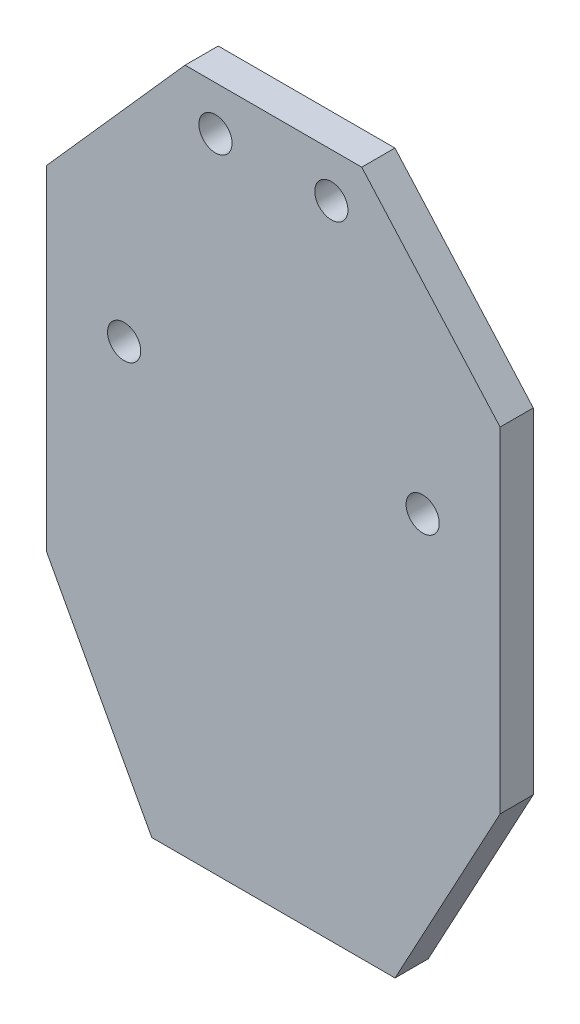
ISO-10303-21;
HEADER;
FILE_DESCRIPTION(('STEP AP214'),'2;1');
FILE_NAME('part.step','',(''),(''),'','','');
FILE_SCHEMA(('AUTOMOTIVE_DESIGN { 1 0 10303 214 1 1 1 1 }'));
ENDSEC;
DATA;
#1=APPLICATION_CONTEXT('core data for automotive mechanical design processes');
#2=APPLICATION_PROTOCOL_DEFINITION('international standard','automotive_design',2000,#1);
#3=PRODUCT_CONTEXT('',#1,'mechanical');
#4=PRODUCT('Part','Part','',(#3));
#5=PRODUCT_RELATED_PRODUCT_CATEGORY('part','',(#4));
#6=PRODUCT_DEFINITION_FORMATION('','',#4);
#7=PRODUCT_DEFINITION_CONTEXT('part definition',#1,'design');
#8=PRODUCT_DEFINITION('design','',#6,#7);
#9=PRODUCT_DEFINITION_SHAPE('','',#8);
#10=(LENGTH_UNIT() NAMED_UNIT(*) SI_UNIT(.MILLI.,.METRE.));
#11=(NAMED_UNIT(*) PLANE_ANGLE_UNIT() SI_UNIT($,.RADIAN.));
#12=(NAMED_UNIT(*) SI_UNIT($,.STERADIAN.) SOLID_ANGLE_UNIT());
#13=UNCERTAINTY_MEASURE_WITH_UNIT(LENGTH_MEASURE(1.E-05),#10,'distance_accuracy_value','');
#14=(GEOMETRIC_REPRESENTATION_CONTEXT(3) GLOBAL_UNCERTAINTY_ASSIGNED_CONTEXT((#13)) GLOBAL_UNIT_ASSIGNED_CONTEXT((#10,
#11,#12)) REPRESENTATION_CONTEXT('',''));
#15=CARTESIAN_POINT('',(0.,0.,0.));
#16=DIRECTION('',(0.,0.,1.));
#17=DIRECTION('',(1.,0.,0.));
#18=AXIS2_PLACEMENT_3D('',#15,#16,#17);
#19=CARTESIAN_POINT('',(0.,0.,3.));
#20=DIRECTION('',(0.,0.,-1.));
#21=DIRECTION('',(-1.,0.,0.));
#22=AXIS2_PLACEMENT_3D('',#19,#20,#21);
#23=PLANE('',#22);
#24=DIRECTION('',(0.475,-0.879985795339902,0.));
#25=VECTOR('',#24,1.);
#26=CARTESIAN_POINT('',(-11.,0.,3.));
#27=LINE('',#26,#25);
#28=CARTESIAN_POINT('',(-20.5,17.599715906798,3.));
#29=VERTEX_POINT('',#28);
#30=CARTESIAN_POINT('',(-11.,0.,3.));
#31=VERTEX_POINT('',#30);
#32=EDGE_CURVE('E153',#29,#31,#27,.T.);
#33=ORIENTED_EDGE('',*,*,#32,.T.);
#34=DIRECTION('',(1.,0.,0.));
#35=VECTOR('',#34,1.);
#36=CARTESIAN_POINT('',(11.,0.,3.));
#37=LINE('',#36,#35);
#38=CARTESIAN_POINT('',(11.,0.,3.));
#39=VERTEX_POINT('',#38);
#40=EDGE_CURVE('E101',#31,#39,#37,.T.);
#41=ORIENTED_EDGE('',*,*,#40,.T.);
#42=DIRECTION('',(0.475,0.879985795339902,0.));
#43=VECTOR('',#42,1.);
#44=CARTESIAN_POINT('',(11.,0.,3.));
#45=LINE('',#44,#43);
#46=CARTESIAN_POINT('',(20.5,17.599715906798,3.));
#47=VERTEX_POINT('',#46);
#48=EDGE_CURVE('E168',#39,#47,#45,.T.);
#49=ORIENTED_EDGE('',*,*,#48,.T.);
#50=DIRECTION('',(0.,1.,0.));
#51=VECTOR('',#50,1.);
#52=CARTESIAN_POINT('',(20.5,17.599715906798,3.));
#53=LINE('',#52,#51);
#54=CARTESIAN_POINT('',(20.5,47.899715906798,3.));
#55=VERTEX_POINT('',#54);
#56=EDGE_CURVE('E181',#47,#55,#53,.T.);
#57=ORIENTED_EDGE('',*,*,#56,.T.);
#58=DIRECTION('',(-0.663669782392083,0.748025681336975,0.));
#59=VECTOR('',#58,1.);
#60=CARTESIAN_POINT('',(20.5,47.899715906798,3.));
#61=LINE('',#60,#59);
#62=CARTESIAN_POINT('',(7.98982460190923,62.,3.));
#63=VERTEX_POINT('',#62);
#64=EDGE_CURVE('E120',#55,#63,#61,.T.);
#65=ORIENTED_EDGE('',*,*,#64,.T.);
#66=DIRECTION('',(-1.,0.,0.));
#67=VECTOR('',#66,1.);
#68=CARTESIAN_POINT('',(-7.98982460190923,62.,3.));
#69=LINE('',#68,#67);
#70=CARTESIAN_POINT('',(-7.98982460190923,62.,3.));
#71=VERTEX_POINT('',#70);
#72=EDGE_CURVE('E114',#63,#71,#69,.T.);
#73=ORIENTED_EDGE('',*,*,#72,.T.);
#74=DIRECTION('',(-0.663669782392083,-0.748025681336975,0.));
#75=VECTOR('',#74,1.);
#76=CARTESIAN_POINT('',(-20.5,47.899715906798,3.));
#77=LINE('',#76,#75);
#78=CARTESIAN_POINT('',(-20.5,47.899715906798,3.));
#79=VERTEX_POINT('',#78);
#80=EDGE_CURVE('E118',#71,#79,#77,.T.);
#81=ORIENTED_EDGE('',*,*,#80,.T.);
#82=DIRECTION('',(0.,-1.,0.));
#83=VECTOR('',#82,1.);
#84=CARTESIAN_POINT('',(-20.5,17.599715906798,3.));
#85=LINE('',#84,#83);
#86=EDGE_CURVE('E58',#79,#29,#85,.T.);
#87=ORIENTED_EDGE('',*,*,#86,.T.);
#88=EDGE_LOOP('',(#33,#41,#49,#57,#65,#73,#81,#87));
#89=FACE_BOUND('',#88,.T.);
#90=CARTESIAN_POINT('',(-5.23982460190923,58.,3.));
#91=DIRECTION('',(0.,0.,1.));
#92=DIRECTION('',(1.,0.,0.));
#93=AXIS2_PLACEMENT_3D('',#90,#91,#92);
#94=CIRCLE('',#93,1.5);
#95=CARTESIAN_POINT('',(-3.73982460190923,58.,3.));
#96=VERTEX_POINT('',#95);
#97=EDGE_CURVE('E142',#96,#96,#94,.T.);
#98=ORIENTED_EDGE('',*,*,#97,.F.);
#99=EDGE_LOOP('',(#98));
#100=FACE_BOUND('',#99,.T.);
#101=CARTESIAN_POINT('',(-13.5,37.599715906798,3.));
#102=DIRECTION('',(0.,0.,1.));
#103=DIRECTION('',(1.,0.,0.));
#104=AXIS2_PLACEMENT_3D('',#101,#102,#103);
#105=CIRCLE('',#104,1.5);
#106=CARTESIAN_POINT('',(-12.,37.599715906798,3.));
#107=VERTEX_POINT('',#106);
#108=EDGE_CURVE('E190',#107,#107,#105,.T.);
#109=ORIENTED_EDGE('',*,*,#108,.F.);
#110=EDGE_LOOP('',(#109));
#111=FACE_BOUND('',#110,.T.);
#112=CARTESIAN_POINT('',(13.5,37.599715906798,3.));
#113=DIRECTION('',(0.,0.,1.));
#114=DIRECTION('',(-1.,0.,0.));
#115=AXIS2_PLACEMENT_3D('',#112,#113,#114);
#116=CIRCLE('',#115,1.5);
#117=CARTESIAN_POINT('',(12.,37.599715906798,3.));
#118=VERTEX_POINT('',#117);
#119=EDGE_CURVE('E196',#118,#118,#116,.T.);
#120=ORIENTED_EDGE('',*,*,#119,.F.);
#121=EDGE_LOOP('',(#120));
#122=FACE_BOUND('',#121,.T.);
#123=CARTESIAN_POINT('',(5.23982460190923,58.,3.));
#124=DIRECTION('',(0.,0.,1.));
#125=DIRECTION('',(-1.,0.,0.));
#126=AXIS2_PLACEMENT_3D('',#123,#124,#125);
#127=CIRCLE('',#126,1.5);
#128=CARTESIAN_POINT('',(3.73982460190923,58.,3.));
#129=VERTEX_POINT('',#128);
#130=EDGE_CURVE('E202',#129,#129,#127,.T.);
#131=ORIENTED_EDGE('',*,*,#130,.F.);
#132=EDGE_LOOP('',(#131));
#133=FACE_BOUND('',#132,.T.);
#134=ADVANCED_FACE('F41',(#89,#100,#111,#122,#133),#23,.F.);
#135=CARTESIAN_POINT('',(0.,0.,0.));
#136=DIRECTION('',(0.,0.,-1.));
#137=DIRECTION('',(-1.,0.,0.));
#138=AXIS2_PLACEMENT_3D('',#135,#136,#137);
#139=PLANE('',#138);
#140=CARTESIAN_POINT('',(13.5,37.599715906798,0.));
#141=DIRECTION('',(0.,0.,1.));
#142=DIRECTION('',(-1.,0.,0.));
#143=AXIS2_PLACEMENT_3D('',#140,#141,#142);
#144=CIRCLE('',#143,1.5);
#145=CARTESIAN_POINT('',(12.,37.599715906798,0.));
#146=VERTEX_POINT('',#145);
#147=EDGE_CURVE('E199',#146,#146,#144,.T.);
#148=ORIENTED_EDGE('',*,*,#147,.T.);
#149=EDGE_LOOP('',(#148));
#150=FACE_BOUND('',#149,.T.);
#151=CARTESIAN_POINT('',(-5.23982460190923,58.,0.));
#152=DIRECTION('',(0.,0.,1.));
#153=DIRECTION('',(1.,0.,0.));
#154=AXIS2_PLACEMENT_3D('',#151,#152,#153);
#155=CIRCLE('',#154,1.5);
#156=CARTESIAN_POINT('',(-3.73982460190923,58.,0.));
#157=VERTEX_POINT('',#156);
#158=EDGE_CURVE('E187',#157,#157,#155,.T.);
#159=ORIENTED_EDGE('',*,*,#158,.T.);
#160=EDGE_LOOP('',(#159));
#161=FACE_BOUND('',#160,.T.);
#162=DIRECTION('',(0.475,-0.879985795339902,0.));
#163=VECTOR('',#162,1.);
#164=CARTESIAN_POINT('',(-11.,0.,0.));
#165=LINE('',#164,#163);
#166=CARTESIAN_POINT('',(-20.5,17.599715906798,0.));
#167=VERTEX_POINT('',#166);
#168=CARTESIAN_POINT('',(-11.,0.,0.));
#169=VERTEX_POINT('',#168);
#170=EDGE_CURVE('E138',#167,#169,#165,.T.);
#171=ORIENTED_EDGE('',*,*,#170,.F.);
#172=DIRECTION('',(0.,-1.,0.));
#173=VECTOR('',#172,1.);
#174=CARTESIAN_POINT('',(-20.5,17.599715906798,0.));
#175=LINE('',#174,#173);
#176=CARTESIAN_POINT('',(-20.5,47.899715906798,0.));
#177=VERTEX_POINT('',#176);
#178=EDGE_CURVE('E93',#177,#167,#175,.T.);
#179=ORIENTED_EDGE('',*,*,#178,.F.);
#180=DIRECTION('',(-0.663669782392083,-0.748025681336975,0.));
#181=VECTOR('',#180,1.);
#182=CARTESIAN_POINT('',(-20.5,47.899715906798,0.));
#183=LINE('',#182,#181);
#184=CARTESIAN_POINT('',(-7.98982460190923,62.,0.));
#185=VERTEX_POINT('',#184);
#186=EDGE_CURVE('E87',#185,#177,#183,.T.);
#187=ORIENTED_EDGE('',*,*,#186,.F.);
#188=DIRECTION('',(-1.,0.,0.));
#189=VECTOR('',#188,1.);
#190=CARTESIAN_POINT('',(-7.98982460190923,62.,0.));
#191=LINE('',#190,#189);
#192=CARTESIAN_POINT('',(7.98982460190923,62.,0.));
#193=VERTEX_POINT('',#192);
#194=EDGE_CURVE('E128',#193,#185,#191,.T.);
#195=ORIENTED_EDGE('',*,*,#194,.F.);
#196=DIRECTION('',(-0.663669782392083,0.748025681336975,0.));
#197=VECTOR('',#196,1.);
#198=CARTESIAN_POINT('',(20.5,47.899715906798,0.));
#199=LINE('',#198,#197);
#200=CARTESIAN_POINT('',(20.5,47.899715906798,0.));
#201=VERTEX_POINT('',#200);
#202=EDGE_CURVE('E148',#201,#193,#199,.T.);
#203=ORIENTED_EDGE('',*,*,#202,.F.);
#204=DIRECTION('',(0.,1.,0.));
#205=VECTOR('',#204,1.);
#206=CARTESIAN_POINT('',(20.5,17.599715906798,0.));
#207=LINE('',#206,#205);
#208=CARTESIAN_POINT('',(20.5,17.599715906798,0.));
#209=VERTEX_POINT('',#208);
#210=EDGE_CURVE('E146',#209,#201,#207,.T.);
#211=ORIENTED_EDGE('',*,*,#210,.F.);
#212=DIRECTION('',(0.475,0.879985795339902,0.));
#213=VECTOR('',#212,1.);
#214=CARTESIAN_POINT('',(11.,0.,0.));
#215=LINE('',#214,#213);
#216=CARTESIAN_POINT('',(11.,0.,0.));
#217=VERTEX_POINT('',#216);
#218=EDGE_CURVE('E144',#217,#209,#215,.T.);
#219=ORIENTED_EDGE('',*,*,#218,.F.);
#220=DIRECTION('',(1.,0.,0.));
#221=VECTOR('',#220,1.);
#222=CARTESIAN_POINT('',(11.,0.,0.));
#223=LINE('',#222,#221);
#224=EDGE_CURVE('E141',#169,#217,#223,.T.);
#225=ORIENTED_EDGE('',*,*,#224,.F.);
#226=EDGE_LOOP('',(#171,#179,#187,#195,#203,#211,#219,#225));
#227=FACE_BOUND('',#226,.T.);
#228=CARTESIAN_POINT('',(-13.5,37.599715906798,0.));
#229=DIRECTION('',(0.,0.,1.));
#230=DIRECTION('',(1.,0.,0.));
#231=AXIS2_PLACEMENT_3D('',#228,#229,#230);
#232=CIRCLE('',#231,1.5);
#233=CARTESIAN_POINT('',(-12.,37.599715906798,0.));
#234=VERTEX_POINT('',#233);
#235=EDGE_CURVE('E193',#234,#234,#232,.T.);
#236=ORIENTED_EDGE('',*,*,#235,.T.);
#237=EDGE_LOOP('',(#236));
#238=FACE_BOUND('',#237,.T.);
#239=CARTESIAN_POINT('',(5.23982460190923,58.,0.));
#240=DIRECTION('',(0.,0.,1.));
#241=DIRECTION('',(-1.,0.,0.));
#242=AXIS2_PLACEMENT_3D('',#239,#240,#241);
#243=CIRCLE('',#242,1.5);
#244=CARTESIAN_POINT('',(3.73982460190923,58.,0.));
#245=VERTEX_POINT('',#244);
#246=EDGE_CURVE('E205',#245,#245,#243,.T.);
#247=ORIENTED_EDGE('',*,*,#246,.T.);
#248=EDGE_LOOP('',(#247));
#249=FACE_BOUND('',#248,.T.);
#250=ADVANCED_FACE('F172',(#150,#161,#227,#238,#249),#139,.T.);
#251=CARTESIAN_POINT('',(-11.,0.,3.));
#252=DIRECTION('',(0.879985795339902,0.475,0.));
#253=DIRECTION('',(-0.475,0.879985795339902,0.));
#254=AXIS2_PLACEMENT_3D('',#251,#252,#253);
#255=PLANE('',#254);
#256=ORIENTED_EDGE('',*,*,#170,.T.);
#257=DIRECTION('',(0.,0.,-1.));
#258=VECTOR('',#257,1.);
#259=CARTESIAN_POINT('',(-11.,0.,3.));
#260=LINE('',#259,#258);
#261=EDGE_CURVE('E11',#31,#169,#260,.T.);
#262=ORIENTED_EDGE('',*,*,#261,.F.);
#263=ORIENTED_EDGE('',*,*,#32,.F.);
#264=DIRECTION('',(0.,0.,-1.));
#265=VECTOR('',#264,1.);
#266=CARTESIAN_POINT('',(-20.5,17.599715906798,3.));
#267=LINE('',#266,#265);
#268=EDGE_CURVE('E134',#29,#167,#267,.T.);
#269=ORIENTED_EDGE('',*,*,#268,.T.);
#270=EDGE_LOOP('',(#256,#262,#263,#269));
#271=FACE_BOUND('',#270,.T.);
#272=ADVANCED_FACE('F43',(#271),#255,.F.);
#273=CARTESIAN_POINT('',(11.,0.,3.));
#274=DIRECTION('',(0.,1.,0.));
#275=DIRECTION('',(0.,0.,1.));
#276=AXIS2_PLACEMENT_3D('',#273,#274,#275);
#277=PLANE('',#276);
#278=ORIENTED_EDGE('',*,*,#224,.T.);
#279=DIRECTION('',(0.,0.,-1.));
#280=VECTOR('',#279,1.);
#281=CARTESIAN_POINT('',(11.,0.,3.));
#282=LINE('',#281,#280);
#283=EDGE_CURVE('E50',#39,#217,#282,.T.);
#284=ORIENTED_EDGE('',*,*,#283,.F.);
#285=ORIENTED_EDGE('',*,*,#40,.F.);
#286=ORIENTED_EDGE('',*,*,#261,.T.);
#287=EDGE_LOOP('',(#278,#284,#285,#286));
#288=FACE_BOUND('',#287,.T.);
#289=ADVANCED_FACE('F237',(#288),#277,.F.);
#290=CARTESIAN_POINT('',(11.,0.,3.));
#291=DIRECTION('',(-0.879985795339902,0.475,0.));
#292=DIRECTION('',(-0.475,-0.879985795339902,0.));
#293=AXIS2_PLACEMENT_3D('',#290,#291,#292);
#294=PLANE('',#293);
#295=ORIENTED_EDGE('',*,*,#218,.T.);
#296=DIRECTION('',(0.,0.,-1.));
#297=VECTOR('',#296,1.);
#298=CARTESIAN_POINT('',(20.5,17.599715906798,3.));
#299=LINE('',#298,#297);
#300=EDGE_CURVE('E160',#47,#209,#299,.T.);
#301=ORIENTED_EDGE('',*,*,#300,.F.);
#302=ORIENTED_EDGE('',*,*,#48,.F.);
#303=ORIENTED_EDGE('',*,*,#283,.T.);
#304=EDGE_LOOP('',(#295,#301,#302,#303));
#305=FACE_BOUND('',#304,.T.);
#306=ADVANCED_FACE('F166',(#305),#294,.F.);
#307=CARTESIAN_POINT('',(20.5,17.599715906798,3.));
#308=DIRECTION('',(-1.,0.,0.));
#309=DIRECTION('',(0.,0.,1.));
#310=AXIS2_PLACEMENT_3D('',#307,#308,#309);
#311=PLANE('',#310);
#312=ORIENTED_EDGE('',*,*,#210,.T.);
#313=DIRECTION('',(0.,0.,-1.));
#314=VECTOR('',#313,1.);
#315=CARTESIAN_POINT('',(20.5,47.899715906798,3.));
#316=LINE('',#315,#314);
#317=EDGE_CURVE('E157',#55,#201,#316,.T.);
#318=ORIENTED_EDGE('',*,*,#317,.F.);
#319=ORIENTED_EDGE('',*,*,#56,.F.);
#320=ORIENTED_EDGE('',*,*,#300,.T.);
#321=EDGE_LOOP('',(#312,#318,#319,#320));
#322=FACE_BOUND('',#321,.T.);
#323=ADVANCED_FACE('F177',(#322),#311,.F.);
#324=CARTESIAN_POINT('',(20.5,47.899715906798,3.));
#325=DIRECTION('',(-0.748025681336974,-0.663669782392083,0.));
#326=DIRECTION('',(0.663669782392083,-0.748025681336975,0.));
#327=AXIS2_PLACEMENT_3D('',#324,#325,#326);
#328=PLANE('',#327);
#329=ORIENTED_EDGE('',*,*,#202,.T.);
#330=DIRECTION('',(0.,0.,-1.));
#331=VECTOR('',#330,1.);
#332=CARTESIAN_POINT('',(7.98982460190923,62.,3.));
#333=LINE('',#332,#331);
#334=EDGE_CURVE('E129',#63,#193,#333,.T.);
#335=ORIENTED_EDGE('',*,*,#334,.F.);
#336=ORIENTED_EDGE('',*,*,#64,.F.);
#337=ORIENTED_EDGE('',*,*,#317,.T.);
#338=EDGE_LOOP('',(#329,#335,#336,#337));
#339=FACE_BOUND('',#338,.T.);
#340=ADVANCED_FACE('F180',(#339),#328,.F.);
#341=CARTESIAN_POINT('',(-7.98982460190923,62.,3.));
#342=DIRECTION('',(0.,-1.,0.));
#343=DIRECTION('',(0.,0.,-1.));
#344=AXIS2_PLACEMENT_3D('',#341,#342,#343);
#345=PLANE('',#344);
#346=ORIENTED_EDGE('',*,*,#194,.T.);
#347=DIRECTION('',(0.,0.,-1.));
#348=VECTOR('',#347,1.);
#349=CARTESIAN_POINT('',(-7.98982460190923,62.,3.));
#350=LINE('',#349,#348);
#351=EDGE_CURVE('E125',#71,#185,#350,.T.);
#352=ORIENTED_EDGE('',*,*,#351,.F.);
#353=ORIENTED_EDGE('',*,*,#72,.F.);
#354=ORIENTED_EDGE('',*,*,#334,.T.);
#355=EDGE_LOOP('',(#346,#352,#353,#354));
#356=FACE_BOUND('',#355,.T.);
#357=ADVANCED_FACE('F126',(#356),#345,.F.);
#358=CARTESIAN_POINT('',(-20.5,47.899715906798,3.));
#359=DIRECTION('',(0.748025681336974,-0.663669782392083,0.));
#360=DIRECTION('',(0.663669782392083,0.748025681336975,0.));
#361=AXIS2_PLACEMENT_3D('',#358,#359,#360);
#362=PLANE('',#361);
#363=ORIENTED_EDGE('',*,*,#186,.T.);
#364=DIRECTION('',(0.,0.,-1.));
#365=VECTOR('',#364,1.);
#366=CARTESIAN_POINT('',(-20.5,47.899715906798,3.));
#367=LINE('',#366,#365);
#368=EDGE_CURVE('E130',#79,#177,#367,.T.);
#369=ORIENTED_EDGE('',*,*,#368,.F.);
#370=ORIENTED_EDGE('',*,*,#80,.F.);
#371=ORIENTED_EDGE('',*,*,#351,.T.);
#372=EDGE_LOOP('',(#363,#369,#370,#371));
#373=FACE_BOUND('',#372,.T.);
#374=ADVANCED_FACE('F132',(#373),#362,.F.);
#375=CARTESIAN_POINT('',(-20.5,17.599715906798,3.));
#376=DIRECTION('',(1.,0.,0.));
#377=DIRECTION('',(0.,0.,-1.));
#378=AXIS2_PLACEMENT_3D('',#375,#376,#377);
#379=PLANE('',#378);
#380=ORIENTED_EDGE('',*,*,#178,.T.);
#381=ORIENTED_EDGE('',*,*,#268,.F.);
#382=ORIENTED_EDGE('',*,*,#86,.F.);
#383=ORIENTED_EDGE('',*,*,#368,.T.);
#384=EDGE_LOOP('',(#380,#381,#382,#383));
#385=FACE_BOUND('',#384,.T.);
#386=ADVANCED_FACE('F225',(#385),#379,.F.);
#387=CARTESIAN_POINT('',(-5.23982460190923,58.,3.));
#388=DIRECTION('',(0.,0.,-1.));
#389=DIRECTION('',(-1.,0.,0.));
#390=AXIS2_PLACEMENT_3D('',#387,#388,#389);
#391=CYLINDRICAL_SURFACE('',#390,1.5);
#392=ORIENTED_EDGE('',*,*,#97,.T.);
#393=EDGE_LOOP('',(#392));
#394=FACE_BOUND('',#393,.T.);
#395=ORIENTED_EDGE('',*,*,#158,.F.);
#396=EDGE_LOOP('',(#395));
#397=FACE_BOUND('',#396,.T.);
#398=ADVANCED_FACE('F222',(#394,#397),#391,.F.);
#399=CARTESIAN_POINT('',(-13.5,37.599715906798,3.));
#400=DIRECTION('',(0.,0.,-1.));
#401=DIRECTION('',(-1.,0.,0.));
#402=AXIS2_PLACEMENT_3D('',#399,#400,#401);
#403=CYLINDRICAL_SURFACE('',#402,1.5);
#404=ORIENTED_EDGE('',*,*,#108,.T.);
#405=EDGE_LOOP('',(#404));
#406=FACE_BOUND('',#405,.T.);
#407=ORIENTED_EDGE('',*,*,#235,.F.);
#408=EDGE_LOOP('',(#407));
#409=FACE_BOUND('',#408,.T.);
#410=ADVANCED_FACE('F300',(#406,#409),#403,.F.);
#411=CARTESIAN_POINT('',(13.5,37.599715906798,3.));
#412=DIRECTION('',(0.,0.,-1.));
#413=DIRECTION('',(-1.,0.,0.));
#414=AXIS2_PLACEMENT_3D('',#411,#412,#413);
#415=CYLINDRICAL_SURFACE('',#414,1.5);
#416=ORIENTED_EDGE('',*,*,#119,.T.);
#417=EDGE_LOOP('',(#416));
#418=FACE_BOUND('',#417,.T.);
#419=ORIENTED_EDGE('',*,*,#147,.F.);
#420=EDGE_LOOP('',(#419));
#421=FACE_BOUND('',#420,.T.);
#422=ADVANCED_FACE('F308',(#418,#421),#415,.F.);
#423=CARTESIAN_POINT('',(5.23982460190923,58.,3.));
#424=DIRECTION('',(0.,0.,-1.));
#425=DIRECTION('',(-1.,0.,0.));
#426=AXIS2_PLACEMENT_3D('',#423,#424,#425);
#427=CYLINDRICAL_SURFACE('',#426,1.5);
#428=ORIENTED_EDGE('',*,*,#130,.T.);
#429=EDGE_LOOP('',(#428));
#430=FACE_BOUND('',#429,.T.);
#431=ORIENTED_EDGE('',*,*,#246,.F.);
#432=EDGE_LOOP('',(#431));
#433=FACE_BOUND('',#432,.T.);
#434=ADVANCED_FACE('F211',(#430,#433),#427,.F.);
#435=CLOSED_SHELL('',(#134,#250,#272,#289,#306,#323,#340,#357,#374,#386,#398,#410,#422,#434));
#436=MANIFOLD_SOLID_BREP('B2',#435);
#437=ADVANCED_BREP_SHAPE_REPRESENTATION('',(#18,#436),#14);
#438=SHAPE_DEFINITION_REPRESENTATION(#9,#437);
ENDSEC;
END-ISO-10303-21;
